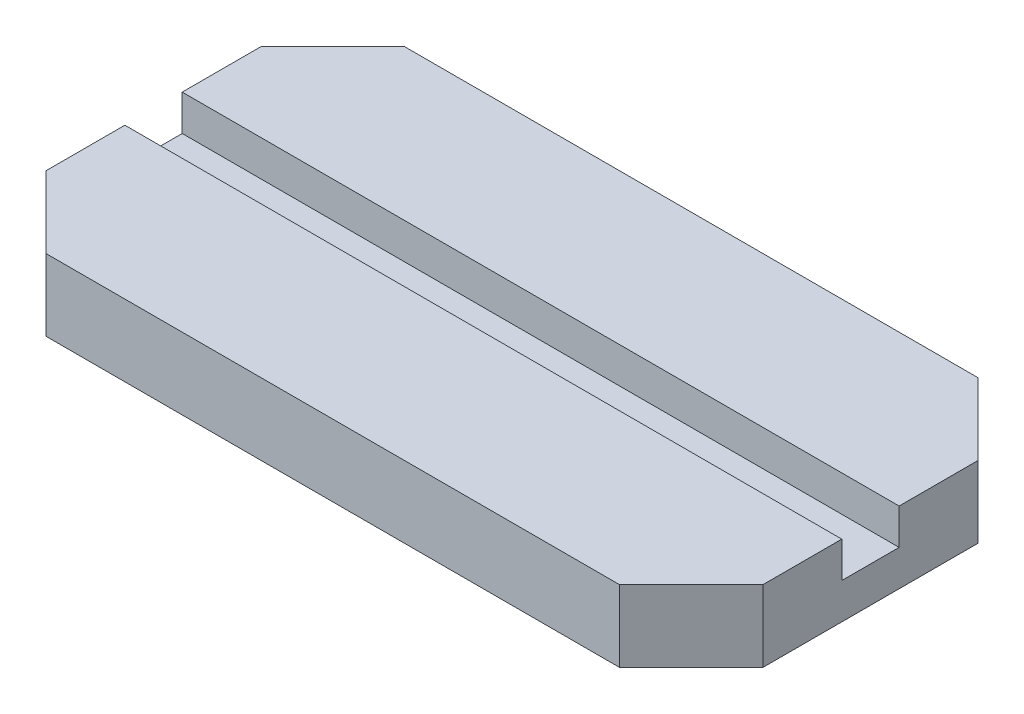
ISO-10303-21;
HEADER;
FILE_DESCRIPTION(('STEP AP214'),'2;1');
FILE_NAME('part.step','',(''),(''),'','','');
FILE_SCHEMA(('AUTOMOTIVE_DESIGN { 1 0 10303 214 1 1 1 1 }'));
ENDSEC;
DATA;
#1=APPLICATION_CONTEXT('core data for automotive mechanical design processes');
#2=APPLICATION_PROTOCOL_DEFINITION('international standard','automotive_design',2000,#1);
#3=PRODUCT_CONTEXT('',#1,'mechanical');
#4=PRODUCT('Part','Part','',(#3));
#5=PRODUCT_RELATED_PRODUCT_CATEGORY('part','',(#4));
#6=PRODUCT_DEFINITION_FORMATION('','',#4);
#7=PRODUCT_DEFINITION_CONTEXT('part definition',#1,'design');
#8=PRODUCT_DEFINITION('design','',#6,#7);
#9=PRODUCT_DEFINITION_SHAPE('','',#8);
#10=(LENGTH_UNIT() NAMED_UNIT(*) SI_UNIT(.MILLI.,.METRE.));
#11=(NAMED_UNIT(*) PLANE_ANGLE_UNIT() SI_UNIT($,.RADIAN.));
#12=(NAMED_UNIT(*) SI_UNIT($,.STERADIAN.) SOLID_ANGLE_UNIT());
#13=UNCERTAINTY_MEASURE_WITH_UNIT(LENGTH_MEASURE(1.E-05),#10,'distance_accuracy_value','');
#14=(GEOMETRIC_REPRESENTATION_CONTEXT(3) GLOBAL_UNCERTAINTY_ASSIGNED_CONTEXT((#13)) GLOBAL_UNIT_ASSIGNED_CONTEXT((#10,
#11,#12)) REPRESENTATION_CONTEXT('',''));
#15=CARTESIAN_POINT('',(0.,0.,0.));
#16=DIRECTION('',(0.,0.,1.));
#17=DIRECTION('',(1.,0.,0.));
#18=AXIS2_PLACEMENT_3D('',#15,#16,#17);
#19=CARTESIAN_POINT('',(0.,10.,0.));
#20=DIRECTION('',(0.,1.,0.));
#21=DIRECTION('',(0.,0.,1.));
#22=AXIS2_PLACEMENT_3D('',#19,#20,#21);
#23=PLANE('',#22);
#24=DIRECTION('',(-1.,0.,0.));
#25=VECTOR('',#24,1.);
#26=CARTESIAN_POINT('',(0.,10.,-4.));
#27=LINE('',#26,#25);
#28=CARTESIAN_POINT('',(50.,10.,-4.));
#29=VERTEX_POINT('',#28);
#30=CARTESIAN_POINT('',(-50.,10.,-4.));
#31=VERTEX_POINT('',#30);
#32=EDGE_CURVE('E54',#29,#31,#27,.T.);
#33=ORIENTED_EDGE('',*,*,#32,.F.);
#34=DIRECTION('',(0.,0.,-1.));
#35=VECTOR('',#34,1.);
#36=CARTESIAN_POINT('',(50.,10.,-25.));
#37=LINE('',#36,#35);
#38=CARTESIAN_POINT('',(50.,10.,-15.));
#39=VERTEX_POINT('',#38);
#40=EDGE_CURVE('E69',#29,#39,#37,.T.);
#41=ORIENTED_EDGE('',*,*,#40,.T.);
#42=DIRECTION('',(0.707106781186547,0.,0.707106781186549));
#43=VECTOR('',#42,1.);
#44=CARTESIAN_POINT('',(32.5,10.,-32.5));
#45=LINE('',#44,#43);
#46=CARTESIAN_POINT('',(40.,10.,-25.));
#47=VERTEX_POINT('',#46);
#48=EDGE_CURVE('E199',#39,#47,#45,.F.);
#49=ORIENTED_EDGE('',*,*,#48,.T.);
#50=DIRECTION('',(-1.,0.,0.));
#51=VECTOR('',#50,1.);
#52=CARTESIAN_POINT('',(-50.,10.,-25.));
#53=LINE('',#52,#51);
#54=CARTESIAN_POINT('',(-40.,10.,-25.));
#55=VERTEX_POINT('',#54);
#56=EDGE_CURVE('E157',#47,#55,#53,.T.);
#57=ORIENTED_EDGE('',*,*,#56,.T.);
#58=DIRECTION('',(0.707106781186549,0.,-0.707106781186547));
#59=VECTOR('',#58,1.);
#60=CARTESIAN_POINT('',(-32.4999999999999,10.,-32.5));
#61=LINE('',#60,#59);
#62=CARTESIAN_POINT('',(-50.,10.,-15.));
#63=VERTEX_POINT('',#62);
#64=EDGE_CURVE('E203',#55,#63,#61,.F.);
#65=ORIENTED_EDGE('',*,*,#64,.T.);
#66=DIRECTION('',(0.,0.,1.));
#67=VECTOR('',#66,1.);
#68=CARTESIAN_POINT('',(-50.,10.,-25.));
#69=LINE('',#68,#67);
#70=EDGE_CURVE('E224',#63,#31,#69,.T.);
#71=ORIENTED_EDGE('',*,*,#70,.T.);
#72=EDGE_LOOP('',(#33,#41,#49,#57,#65,#71));
#73=FACE_BOUND('',#72,.T.);
#74=ADVANCED_FACE('F45',(#73),#23,.T.);
#75=CARTESIAN_POINT('',(-50.,10.,-25.));
#76=DIRECTION('',(1.,0.,0.));
#77=DIRECTION('',(0.,0.,-1.));
#78=AXIS2_PLACEMENT_3D('',#75,#76,#77);
#79=PLANE('',#78);
#80=DIRECTION('',(0.,0.,1.));
#81=VECTOR('',#80,1.);
#82=CARTESIAN_POINT('',(-50.,5.,-25.));
#83=LINE('',#82,#81);
#84=CARTESIAN_POINT('',(-50.,5.,-4.));
#85=VERTEX_POINT('',#84);
#86=CARTESIAN_POINT('',(-50.,5.,4.));
#87=VERTEX_POINT('',#86);
#88=EDGE_CURVE('E170',#85,#87,#83,.T.);
#89=ORIENTED_EDGE('',*,*,#88,.F.);
#90=DIRECTION('',(0.,1.,0.));
#91=VECTOR('',#90,1.);
#92=CARTESIAN_POINT('',(-50.,10.,-4.));
#93=LINE('',#92,#91);
#94=EDGE_CURVE('E216',#85,#31,#93,.T.);
#95=ORIENTED_EDGE('',*,*,#94,.T.);
#96=ORIENTED_EDGE('',*,*,#70,.F.);
#97=DIRECTION('',(0.,-1.,0.));
#98=VECTOR('',#97,1.);
#99=CARTESIAN_POINT('',(-50.,10.,-15.));
#100=LINE('',#99,#98);
#101=CARTESIAN_POINT('',(-50.,0.,-15.));
#102=VERTEX_POINT('',#101);
#103=EDGE_CURVE('E182',#63,#102,#100,.T.);
#104=ORIENTED_EDGE('',*,*,#103,.T.);
#105=DIRECTION('',(0.,0.,1.));
#106=VECTOR('',#105,1.);
#107=CARTESIAN_POINT('',(-50.,0.,-25.));
#108=LINE('',#107,#106);
#109=CARTESIAN_POINT('',(-50.,0.,15.));
#110=VERTEX_POINT('',#109);
#111=EDGE_CURVE('E166',#102,#110,#108,.T.);
#112=ORIENTED_EDGE('',*,*,#111,.T.);
#113=DIRECTION('',(0.,1.,0.));
#114=VECTOR('',#113,1.);
#115=CARTESIAN_POINT('',(-50.,10.,15.));
#116=LINE('',#115,#114);
#117=CARTESIAN_POINT('',(-50.,10.,15.));
#118=VERTEX_POINT('',#117);
#119=EDGE_CURVE('E160',#110,#118,#116,.T.);
#120=ORIENTED_EDGE('',*,*,#119,.T.);
#121=CARTESIAN_POINT('',(-50.,10.,4.));
#122=VERTEX_POINT('',#121);
#123=EDGE_CURVE('E179',#122,#118,#69,.T.);
#124=ORIENTED_EDGE('',*,*,#123,.F.);
#125=DIRECTION('',(0.,-1.,0.));
#126=VECTOR('',#125,1.);
#127=CARTESIAN_POINT('',(-50.,10.,4.));
#128=LINE('',#127,#126);
#129=EDGE_CURVE('E61',#122,#87,#128,.T.);
#130=ORIENTED_EDGE('',*,*,#129,.T.);
#131=EDGE_LOOP('',(#89,#95,#96,#104,#112,#120,#124,#130));
#132=FACE_BOUND('',#131,.T.);
#133=ADVANCED_FACE('F223',(#132),#79,.F.);
#134=CARTESIAN_POINT('',(-50.,10.,25.));
#135=DIRECTION('',(0.,0.,-1.));
#136=DIRECTION('',(-1.,0.,0.));
#137=AXIS2_PLACEMENT_3D('',#134,#135,#136);
#138=PLANE('',#137);
#139=DIRECTION('',(1.,0.,0.));
#140=VECTOR('',#139,1.);
#141=CARTESIAN_POINT('',(-50.,10.,25.));
#142=LINE('',#141,#140);
#143=CARTESIAN_POINT('',(-40.,10.,25.));
#144=VERTEX_POINT('',#143);
#145=CARTESIAN_POINT('',(39.9999999999999,10.,25.));
#146=VERTEX_POINT('',#145);
#147=EDGE_CURVE('E162',#144,#146,#142,.T.);
#148=ORIENTED_EDGE('',*,*,#147,.F.);
#149=DIRECTION('',(0.,-1.,0.));
#150=VECTOR('',#149,1.);
#151=CARTESIAN_POINT('',(-40.,10.,25.));
#152=LINE('',#151,#150);
#153=CARTESIAN_POINT('',(-40.,0.,25.));
#154=VERTEX_POINT('',#153);
#155=EDGE_CURVE('E207',#144,#154,#152,.T.);
#156=ORIENTED_EDGE('',*,*,#155,.T.);
#157=DIRECTION('',(1.,0.,0.));
#158=VECTOR('',#157,1.);
#159=CARTESIAN_POINT('',(-50.,0.,25.));
#160=LINE('',#159,#158);
#161=CARTESIAN_POINT('',(39.9999999999999,0.,25.));
#162=VERTEX_POINT('',#161);
#163=EDGE_CURVE('E169',#154,#162,#160,.T.);
#164=ORIENTED_EDGE('',*,*,#163,.T.);
#165=DIRECTION('',(0.,1.,0.));
#166=VECTOR('',#165,1.);
#167=CARTESIAN_POINT('',(39.9999999999999,10.,25.));
#168=LINE('',#167,#166);
#169=EDGE_CURVE('E205',#162,#146,#168,.T.);
#170=ORIENTED_EDGE('',*,*,#169,.T.);
#171=EDGE_LOOP('',(#148,#156,#164,#170));
#172=FACE_BOUND('',#171,.T.);
#173=ADVANCED_FACE('F242',(#172),#138,.F.);
#174=CARTESIAN_POINT('',(50.,10.,-25.));
#175=DIRECTION('',(-1.,0.,0.));
#176=DIRECTION('',(0.,0.,1.));
#177=AXIS2_PLACEMENT_3D('',#174,#175,#176);
#178=PLANE('',#177);
#179=ORIENTED_EDGE('',*,*,#40,.F.);
#180=DIRECTION('',(0.,-1.,0.));
#181=VECTOR('',#180,1.);
#182=CARTESIAN_POINT('',(50.,10.,-4.));
#183=LINE('',#182,#181);
#184=CARTESIAN_POINT('',(50.,5.,-4.));
#185=VERTEX_POINT('',#184);
#186=EDGE_CURVE('E218',#29,#185,#183,.T.);
#187=ORIENTED_EDGE('',*,*,#186,.T.);
#188=DIRECTION('',(0.,0.,-1.));
#189=VECTOR('',#188,1.);
#190=CARTESIAN_POINT('',(50.,5.,-25.));
#191=LINE('',#190,#189);
#192=CARTESIAN_POINT('',(50.,5.,4.));
#193=VERTEX_POINT('',#192);
#194=EDGE_CURVE('E11',#193,#185,#191,.T.);
#195=ORIENTED_EDGE('',*,*,#194,.F.);
#196=DIRECTION('',(0.,1.,0.));
#197=VECTOR('',#196,1.);
#198=CARTESIAN_POINT('',(50.,10.,4.));
#199=LINE('',#198,#197);
#200=CARTESIAN_POINT('',(50.,10.,4.));
#201=VERTEX_POINT('',#200);
#202=EDGE_CURVE('E136',#193,#201,#199,.T.);
#203=ORIENTED_EDGE('',*,*,#202,.T.);
#204=CARTESIAN_POINT('',(50.,10.,15.));
#205=VERTEX_POINT('',#204);
#206=EDGE_CURVE('E148',#205,#201,#37,.T.);
#207=ORIENTED_EDGE('',*,*,#206,.F.);
#208=DIRECTION('',(0.,-1.,0.));
#209=VECTOR('',#208,1.);
#210=CARTESIAN_POINT('',(50.,10.,15.));
#211=LINE('',#210,#209);
#212=CARTESIAN_POINT('',(50.,0.,15.));
#213=VERTEX_POINT('',#212);
#214=EDGE_CURVE('E210',#205,#213,#211,.T.);
#215=ORIENTED_EDGE('',*,*,#214,.T.);
#216=DIRECTION('',(0.,0.,-1.));
#217=VECTOR('',#216,1.);
#218=CARTESIAN_POINT('',(50.,0.,-25.));
#219=LINE('',#218,#217);
#220=CARTESIAN_POINT('',(50.,0.,-15.));
#221=VERTEX_POINT('',#220);
#222=EDGE_CURVE('E173',#213,#221,#219,.T.);
#223=ORIENTED_EDGE('',*,*,#222,.T.);
#224=DIRECTION('',(0.,1.,0.));
#225=VECTOR('',#224,1.);
#226=CARTESIAN_POINT('',(50.,10.,-15.));
#227=LINE('',#226,#225);
#228=EDGE_CURVE('E141',#221,#39,#227,.T.);
#229=ORIENTED_EDGE('',*,*,#228,.T.);
#230=EDGE_LOOP('',(#179,#187,#195,#203,#207,#215,#223,#229));
#231=FACE_BOUND('',#230,.T.);
#232=ADVANCED_FACE('F146',(#231),#178,.F.);
#233=CARTESIAN_POINT('',(-50.,10.,-25.));
#234=DIRECTION('',(0.,0.,1.));
#235=DIRECTION('',(1.,0.,0.));
#236=AXIS2_PLACEMENT_3D('',#233,#234,#235);
#237=PLANE('',#236);
#238=DIRECTION('',(-1.,0.,0.));
#239=VECTOR('',#238,1.);
#240=CARTESIAN_POINT('',(-50.,0.,-25.));
#241=LINE('',#240,#239);
#242=CARTESIAN_POINT('',(40.,0.,-25.));
#243=VERTEX_POINT('',#242);
#244=CARTESIAN_POINT('',(-40.,0.,-25.));
#245=VERTEX_POINT('',#244);
#246=EDGE_CURVE('E176',#243,#245,#241,.T.);
#247=ORIENTED_EDGE('',*,*,#246,.T.);
#248=DIRECTION('',(0.,1.,0.));
#249=VECTOR('',#248,1.);
#250=CARTESIAN_POINT('',(-40.,10.,-25.));
#251=LINE('',#250,#249);
#252=EDGE_CURVE('E196',#245,#55,#251,.T.);
#253=ORIENTED_EDGE('',*,*,#252,.T.);
#254=ORIENTED_EDGE('',*,*,#56,.F.);
#255=DIRECTION('',(0.,-1.,0.));
#256=VECTOR('',#255,1.);
#257=CARTESIAN_POINT('',(40.,10.,-25.));
#258=LINE('',#257,#256);
#259=EDGE_CURVE('E193',#47,#243,#258,.T.);
#260=ORIENTED_EDGE('',*,*,#259,.T.);
#261=EDGE_LOOP('',(#247,#253,#254,#260));
#262=FACE_BOUND('',#261,.T.);
#263=ADVANCED_FACE('F254',(#262),#237,.F.);
#264=DIRECTION('',(1.,0.,0.));
#265=VECTOR('',#264,1.);
#266=CARTESIAN_POINT('',(0.,10.,4.));
#267=LINE('',#266,#265);
#268=EDGE_CURVE('E133',#122,#201,#267,.T.);
#269=ORIENTED_EDGE('',*,*,#268,.F.);
#270=ORIENTED_EDGE('',*,*,#123,.T.);
#271=DIRECTION('',(-0.707106781186546,0.,-0.707106781186549));
#272=VECTOR('',#271,1.);
#273=CARTESIAN_POINT('',(-32.5000000000001,10.,32.5));
#274=LINE('',#273,#272);
#275=EDGE_CURVE('E201',#118,#144,#274,.F.);
#276=ORIENTED_EDGE('',*,*,#275,.T.);
#277=ORIENTED_EDGE('',*,*,#147,.T.);
#278=DIRECTION('',(-0.707106781186549,0.,0.707106781186546));
#279=VECTOR('',#278,1.);
#280=CARTESIAN_POINT('',(32.4999999999999,10.,32.5));
#281=LINE('',#280,#279);
#282=EDGE_CURVE('E156',#146,#205,#281,.F.);
#283=ORIENTED_EDGE('',*,*,#282,.T.);
#284=ORIENTED_EDGE('',*,*,#206,.T.);
#285=EDGE_LOOP('',(#269,#270,#276,#277,#283,#284));
#286=FACE_BOUND('',#285,.T.);
#287=ADVANCED_FACE('F153',(#286),#23,.T.);
#288=CARTESIAN_POINT('',(0.,0.,0.));
#289=DIRECTION('',(0.,1.,0.));
#290=DIRECTION('',(0.,0.,1.));
#291=AXIS2_PLACEMENT_3D('',#288,#289,#290);
#292=PLANE('',#291);
#293=ORIENTED_EDGE('',*,*,#111,.F.);
#294=DIRECTION('',(-0.707106781186549,0.,0.707106781186547));
#295=VECTOR('',#294,1.);
#296=CARTESIAN_POINT('',(-50.,0.,-15.));
#297=LINE('',#296,#295);
#298=EDGE_CURVE('E191',#102,#245,#297,.F.);
#299=ORIENTED_EDGE('',*,*,#298,.T.);
#300=ORIENTED_EDGE('',*,*,#246,.F.);
#301=DIRECTION('',(-0.707106781186547,0.,-0.707106781186549));
#302=VECTOR('',#301,1.);
#303=CARTESIAN_POINT('',(40.,0.,-25.));
#304=LINE('',#303,#302);
#305=EDGE_CURVE('E187',#243,#221,#304,.F.);
#306=ORIENTED_EDGE('',*,*,#305,.T.);
#307=ORIENTED_EDGE('',*,*,#222,.F.);
#308=DIRECTION('',(0.707106781186549,0.,-0.707106781186546));
#309=VECTOR('',#308,1.);
#310=CARTESIAN_POINT('',(50.,0.,15.));
#311=LINE('',#310,#309);
#312=EDGE_CURVE('E185',#213,#162,#311,.F.);
#313=ORIENTED_EDGE('',*,*,#312,.T.);
#314=ORIENTED_EDGE('',*,*,#163,.F.);
#315=DIRECTION('',(0.707106781186546,0.,0.707106781186549));
#316=VECTOR('',#315,1.);
#317=CARTESIAN_POINT('',(-40.,0.,25.));
#318=LINE('',#317,#316);
#319=EDGE_CURVE('E189',#154,#110,#318,.F.);
#320=ORIENTED_EDGE('',*,*,#319,.T.);
#321=EDGE_LOOP('',(#293,#299,#300,#306,#307,#313,#314,#320));
#322=FACE_BOUND('',#321,.T.);
#323=ADVANCED_FACE('F248',(#322),#292,.F.);
#324=CARTESIAN_POINT('',(-50.,10.,-15.));
#325=DIRECTION('',(0.707106781186547,0.,0.707106781186549));
#326=DIRECTION('',(0.,-1.,0.));
#327=AXIS2_PLACEMENT_3D('',#324,#325,#326);
#328=PLANE('',#327);
#329=ORIENTED_EDGE('',*,*,#64,.F.);
#330=ORIENTED_EDGE('',*,*,#252,.F.);
#331=ORIENTED_EDGE('',*,*,#298,.F.);
#332=ORIENTED_EDGE('',*,*,#103,.F.);
#333=EDGE_LOOP('',(#329,#330,#331,#332));
#334=FACE_BOUND('',#333,.T.);
#335=ADVANCED_FACE('F250',(#334),#328,.F.);
#336=CARTESIAN_POINT('',(-40.,10.,25.));
#337=DIRECTION('',(0.707106781186549,0.,-0.707106781186546));
#338=DIRECTION('',(0.,-1.,0.));
#339=AXIS2_PLACEMENT_3D('',#336,#337,#338);
#340=PLANE('',#339);
#341=ORIENTED_EDGE('',*,*,#275,.F.);
#342=ORIENTED_EDGE('',*,*,#119,.F.);
#343=ORIENTED_EDGE('',*,*,#319,.F.);
#344=ORIENTED_EDGE('',*,*,#155,.F.);
#345=EDGE_LOOP('',(#341,#342,#343,#344));
#346=FACE_BOUND('',#345,.T.);
#347=ADVANCED_FACE('F245',(#346),#340,.F.);
#348=CARTESIAN_POINT('',(40.,10.,-25.));
#349=DIRECTION('',(-0.707106781186549,0.,0.707106781186547));
#350=DIRECTION('',(0.,-1.,0.));
#351=AXIS2_PLACEMENT_3D('',#348,#349,#350);
#352=PLANE('',#351);
#353=ORIENTED_EDGE('',*,*,#48,.F.);
#354=ORIENTED_EDGE('',*,*,#228,.F.);
#355=ORIENTED_EDGE('',*,*,#305,.F.);
#356=ORIENTED_EDGE('',*,*,#259,.F.);
#357=EDGE_LOOP('',(#353,#354,#355,#356));
#358=FACE_BOUND('',#357,.T.);
#359=ADVANCED_FACE('F259',(#358),#352,.F.);
#360=CARTESIAN_POINT('',(50.,10.,15.));
#361=DIRECTION('',(-0.707106781186546,0.,-0.707106781186549));
#362=DIRECTION('',(0.,-1.,0.));
#363=AXIS2_PLACEMENT_3D('',#360,#361,#362);
#364=PLANE('',#363);
#365=ORIENTED_EDGE('',*,*,#282,.F.);
#366=ORIENTED_EDGE('',*,*,#169,.F.);
#367=ORIENTED_EDGE('',*,*,#312,.F.);
#368=ORIENTED_EDGE('',*,*,#214,.F.);
#369=EDGE_LOOP('',(#365,#366,#367,#368));
#370=FACE_BOUND('',#369,.T.);
#371=ADVANCED_FACE('F48',(#370),#364,.F.);
#372=CARTESIAN_POINT('',(0.,5.,0.));
#373=DIRECTION('',(0.,1.,0.));
#374=DIRECTION('',(0.,0.,1.));
#375=AXIS2_PLACEMENT_3D('',#372,#373,#374);
#376=PLANE('',#375);
#377=ORIENTED_EDGE('',*,*,#88,.T.);
#378=DIRECTION('',(1.,0.,0.));
#379=VECTOR('',#378,1.);
#380=CARTESIAN_POINT('',(-58.3808225040527,5.,4.));
#381=LINE('',#380,#379);
#382=EDGE_CURVE('E233',#87,#193,#381,.T.);
#383=ORIENTED_EDGE('',*,*,#382,.T.);
#384=ORIENTED_EDGE('',*,*,#194,.T.);
#385=DIRECTION('',(-1.,0.,0.));
#386=VECTOR('',#385,1.);
#387=CARTESIAN_POINT('',(-58.3808225040527,5.,-4.));
#388=LINE('',#387,#386);
#389=EDGE_CURVE('E151',#185,#85,#388,.T.);
#390=ORIENTED_EDGE('',*,*,#389,.T.);
#391=EDGE_LOOP('',(#377,#383,#384,#390));
#392=FACE_BOUND('',#391,.T.);
#393=ADVANCED_FACE('F235',(#392),#376,.T.);
#394=CARTESIAN_POINT('',(-58.3808225040527,5.,-4.));
#395=DIRECTION('',(0.,0.,-1.));
#396=DIRECTION('',(-1.,0.,0.));
#397=AXIS2_PLACEMENT_3D('',#394,#395,#396);
#398=PLANE('',#397);
#399=ORIENTED_EDGE('',*,*,#389,.F.);
#400=ORIENTED_EDGE('',*,*,#186,.F.);
#401=ORIENTED_EDGE('',*,*,#32,.T.);
#402=ORIENTED_EDGE('',*,*,#94,.F.);
#403=EDGE_LOOP('',(#399,#400,#401,#402));
#404=FACE_BOUND('',#403,.T.);
#405=ADVANCED_FACE('F215',(#404),#398,.F.);
#406=CARTESIAN_POINT('',(-58.3808225040527,5.,4.));
#407=DIRECTION('',(0.,0.,1.));
#408=DIRECTION('',(1.,0.,0.));
#409=AXIS2_PLACEMENT_3D('',#406,#407,#408);
#410=PLANE('',#409);
#411=ORIENTED_EDGE('',*,*,#268,.T.);
#412=ORIENTED_EDGE('',*,*,#202,.F.);
#413=ORIENTED_EDGE('',*,*,#382,.F.);
#414=ORIENTED_EDGE('',*,*,#129,.F.);
#415=EDGE_LOOP('',(#411,#412,#413,#414));
#416=FACE_BOUND('',#415,.T.);
#417=ADVANCED_FACE('F135',(#416),#410,.F.);
#418=CLOSED_SHELL('',(#74,#133,#173,#232,#263,#287,#323,#335,#347,#359,#371,#393,#405,#417));
#419=MANIFOLD_SOLID_BREP('B2',#418);
#420=ADVANCED_BREP_SHAPE_REPRESENTATION('',(#18,#419),#14);
#421=SHAPE_DEFINITION_REPRESENTATION(#9,#420);
ENDSEC;
END-ISO-10303-21;
